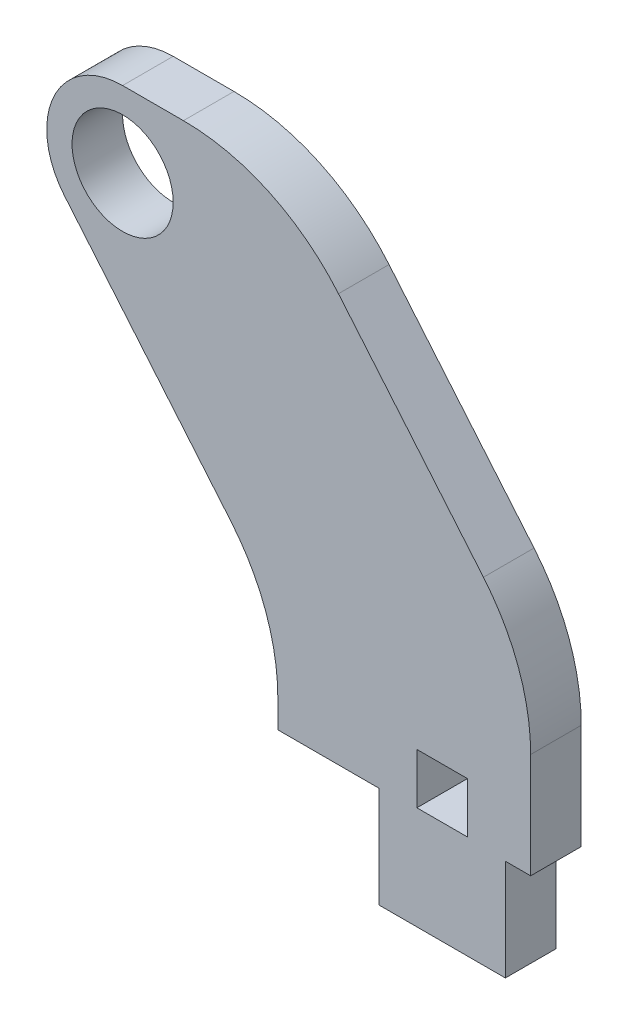
ISO-10303-21;
HEADER;
FILE_DESCRIPTION(('STEP AP214'),'2;1');
FILE_NAME('part.step','',(''),(''),'','','');
FILE_SCHEMA(('AUTOMOTIVE_DESIGN { 1 0 10303 214 1 1 1 1 }'));
ENDSEC;
DATA;
#1=APPLICATION_CONTEXT('core data for automotive mechanical design processes');
#2=APPLICATION_PROTOCOL_DEFINITION('international standard','automotive_design',2000,#1);
#3=PRODUCT_CONTEXT('',#1,'mechanical');
#4=PRODUCT('Part','Part','',(#3));
#5=PRODUCT_RELATED_PRODUCT_CATEGORY('part','',(#4));
#6=PRODUCT_DEFINITION_FORMATION('','',#4);
#7=PRODUCT_DEFINITION_CONTEXT('part definition',#1,'design');
#8=PRODUCT_DEFINITION('design','',#6,#7);
#9=PRODUCT_DEFINITION_SHAPE('','',#8);
#10=(LENGTH_UNIT() NAMED_UNIT(*) SI_UNIT(.MILLI.,.METRE.));
#11=(NAMED_UNIT(*) PLANE_ANGLE_UNIT() SI_UNIT($,.RADIAN.));
#12=(NAMED_UNIT(*) SI_UNIT($,.STERADIAN.) SOLID_ANGLE_UNIT());
#13=UNCERTAINTY_MEASURE_WITH_UNIT(LENGTH_MEASURE(1.E-05),#10,'distance_accuracy_value','');
#14=(GEOMETRIC_REPRESENTATION_CONTEXT(3) GLOBAL_UNCERTAINTY_ASSIGNED_CONTEXT((#13)) GLOBAL_UNIT_ASSIGNED_CONTEXT((#10,
#11,#12)) REPRESENTATION_CONTEXT('',''));
#15=CARTESIAN_POINT('',(0.,0.,0.));
#16=DIRECTION('',(0.,0.,1.));
#17=DIRECTION('',(1.,0.,0.));
#18=AXIS2_PLACEMENT_3D('',#15,#16,#17);
#19=CARTESIAN_POINT('',(-20.066,31.75,3.175));
#20=DIRECTION('',(0.,0.,1.));
#21=DIRECTION('',(1.,0.,0.));
#22=AXIS2_PLACEMENT_3D('',#19,#20,#21);
#23=PLANE('',#22);
#24=DIRECTION('',(0.,1.,0.));
#25=VECTOR('',#24,1.);
#26=CARTESIAN_POINT('',(1.5875,9.652,3.175));
#27=LINE('',#26,#25);
#28=CARTESIAN_POINT('',(1.5875,6.477,3.175));
#29=VERTEX_POINT('',#28);
#30=CARTESIAN_POINT('',(1.5875,9.652,3.175));
#31=VERTEX_POINT('',#30);
#32=EDGE_CURVE('E164',#29,#31,#27,.T.);
#33=ORIENTED_EDGE('',*,*,#32,.F.);
#34=DIRECTION('',(1.,0.,0.));
#35=VECTOR('',#34,1.);
#36=CARTESIAN_POINT('',(-1.5875,6.477,3.175));
#37=LINE('',#36,#35);
#38=CARTESIAN_POINT('',(-1.5875,6.477,3.175));
#39=VERTEX_POINT('',#38);
#40=EDGE_CURVE('E169',#39,#29,#37,.T.);
#41=ORIENTED_EDGE('',*,*,#40,.F.);
#42=DIRECTION('',(0.,-1.,0.));
#43=VECTOR('',#42,1.);
#44=CARTESIAN_POINT('',(-1.5875,9.652,3.175));
#45=LINE('',#44,#43);
#46=CARTESIAN_POINT('',(-1.5875,9.652,3.175));
#47=VERTEX_POINT('',#46);
#48=EDGE_CURVE('E192',#47,#39,#45,.T.);
#49=ORIENTED_EDGE('',*,*,#48,.F.);
#50=DIRECTION('',(-1.,0.,0.));
#51=VECTOR('',#50,1.);
#52=CARTESIAN_POINT('',(-1.5875,9.652,3.175));
#53=LINE('',#52,#51);
#54=EDGE_CURVE('E185',#31,#47,#53,.T.);
#55=ORIENTED_EDGE('',*,*,#54,.F.);
#56=EDGE_LOOP('',(#33,#41,#49,#55));
#57=FACE_BOUND('',#56,.T.);
#58=DIRECTION('',(0.,1.,0.));
#59=VECTOR('',#58,1.);
#60=CARTESIAN_POINT('',(5.55625,6.35,3.175));
#61=LINE('',#60,#59);
#62=CARTESIAN_POINT('',(5.55625,6.35,3.175));
#63=VERTEX_POINT('',#62);
#64=CARTESIAN_POINT('',(5.55625,12.9473421502384,3.175));
#65=VERTEX_POINT('',#64);
#66=EDGE_CURVE('E217',#63,#65,#61,.T.);
#67=ORIENTED_EDGE('',*,*,#66,.T.);
#68=CARTESIAN_POINT('',(-7.14375,12.9473421502384,3.175));
#69=DIRECTION('',(0.,0.,1.));
#70=DIRECTION('',(1.,0.,0.));
#71=AXIS2_PLACEMENT_3D('',#68,#69,#70);
#72=CIRCLE('',#71,12.7);
#73=CARTESIAN_POINT('',(2.59118585036592,21.1033843270089,3.175));
#74=VERTEX_POINT('',#73);
#75=EDGE_CURVE('E293',#65,#74,#72,.T.);
#76=ORIENTED_EDGE('',*,*,#75,.T.);
#77=DIRECTION('',(-0.642208045415005,0.766530381918576,0.));
#78=VECTOR('',#77,1.);
#79=CARTESIAN_POINT('',(-10.31875,36.5125,3.175));
#80=LINE('',#79,#78);
#81=CARTESIAN_POINT('',(-6.51176942761824,31.9685421767706,3.175));
#82=VERTEX_POINT('',#81);
#83=EDGE_CURVE('E220',#74,#82,#80,.T.);
#84=ORIENTED_EDGE('',*,*,#83,.T.);
#85=CARTESIAN_POINT('',(-16.2467052779842,23.8125,3.175));
#86=DIRECTION('',(0.,0.,1.));
#87=DIRECTION('',(1.,0.,0.));
#88=AXIS2_PLACEMENT_3D('',#85,#86,#87);
#89=CIRCLE('',#88,12.7);
#90=CARTESIAN_POINT('',(-16.2467052779842,36.5125,3.175));
#91=VERTEX_POINT('',#90);
#92=EDGE_CURVE('E291',#82,#91,#89,.T.);
#93=ORIENTED_EDGE('',*,*,#92,.T.);
#94=DIRECTION('',(-1.,0.,0.));
#95=VECTOR('',#94,1.);
#96=CARTESIAN_POINT('',(-20.066,36.5125,3.175));
#97=LINE('',#96,#95);
#98=CARTESIAN_POINT('',(-20.066,36.5125,3.175));
#99=VERTEX_POINT('',#98);
#100=EDGE_CURVE('E223',#91,#99,#97,.T.);
#101=ORIENTED_EDGE('',*,*,#100,.T.);
#102=CARTESIAN_POINT('',(-20.066,31.75,3.175));
#103=DIRECTION('',(0.,0.,1.));
#104=DIRECTION('',(1.,0.,0.));
#105=AXIS2_PLACEMENT_3D('',#102,#103,#104);
#106=CIRCLE('',#105,4.7625);
#107=CARTESIAN_POINT('',(-23.7166009438872,28.691484183711,3.175));
#108=VERTEX_POINT('',#107);
#109=EDGE_CURVE('E225',#99,#108,#106,.T.);
#110=ORIENTED_EDGE('',*,*,#109,.T.);
#111=DIRECTION('',(0.642208045415005,-0.766530381918577,0.));
#112=VECTOR('',#111,1.);
#113=CARTESIAN_POINT('',(-23.7166009438872,28.691484183711,3.175));
#114=LINE('',#113,#112);
#115=CARTESIAN_POINT('',(-13.2838141496341,16.2390583647443,3.175));
#116=VERTEX_POINT('',#115);
#117=EDGE_CURVE('E227',#108,#116,#114,.T.);
#118=ORIENTED_EDGE('',*,*,#117,.T.);
#119=CARTESIAN_POINT('',(-23.01875,8.08301618797378,3.175));
#120=DIRECTION('',(0.,0.,1.));
#121=DIRECTION('',(1.,0.,0.));
#122=AXIS2_PLACEMENT_3D('',#119,#120,#121);
#123=CIRCLE('',#122,12.7);
#124=CARTESIAN_POINT('',(-10.31875,8.08301618797378,3.175));
#125=VERTEX_POINT('',#124);
#126=EDGE_CURVE('E11',#116,#125,#123,.F.);
#127=ORIENTED_EDGE('',*,*,#126,.T.);
#128=DIRECTION('',(0.,-1.,0.));
#129=VECTOR('',#128,1.);
#130=CARTESIAN_POINT('',(-10.31875,12.7,3.175));
#131=LINE('',#130,#129);
#132=CARTESIAN_POINT('',(-10.31875,6.35,3.175));
#133=VERTEX_POINT('',#132);
#134=EDGE_CURVE('E229',#125,#133,#131,.T.);
#135=ORIENTED_EDGE('',*,*,#134,.T.);
#136=DIRECTION('',(1.,0.,0.));
#137=VECTOR('',#136,1.);
#138=CARTESIAN_POINT('',(-3.96875,6.35,3.175));
#139=LINE('',#138,#137);
#140=CARTESIAN_POINT('',(-3.96875,6.35,3.175));
#141=VERTEX_POINT('',#140);
#142=EDGE_CURVE('E231',#133,#141,#139,.T.);
#143=ORIENTED_EDGE('',*,*,#142,.T.);
#144=DIRECTION('',(0.,-1.,0.));
#145=VECTOR('',#144,1.);
#146=CARTESIAN_POINT('',(-3.96875,0.,3.175));
#147=LINE('',#146,#145);
#148=CARTESIAN_POINT('',(-3.96875,0.,3.175));
#149=VERTEX_POINT('',#148);
#150=EDGE_CURVE('E207',#141,#149,#147,.T.);
#151=ORIENTED_EDGE('',*,*,#150,.T.);
#152=DIRECTION('',(1.,0.,0.));
#153=VECTOR('',#152,1.);
#154=CARTESIAN_POINT('',(-3.96875,0.,3.175));
#155=LINE('',#154,#153);
#156=CARTESIAN_POINT('',(3.96875,0.,3.175));
#157=VERTEX_POINT('',#156);
#158=EDGE_CURVE('E210',#149,#157,#155,.T.);
#159=ORIENTED_EDGE('',*,*,#158,.T.);
#160=DIRECTION('',(0.,1.,0.));
#161=VECTOR('',#160,1.);
#162=CARTESIAN_POINT('',(3.96875,0.,3.175));
#163=LINE('',#162,#161);
#164=CARTESIAN_POINT('',(3.96875,6.35,3.175));
#165=VERTEX_POINT('',#164);
#166=EDGE_CURVE('E213',#157,#165,#163,.T.);
#167=ORIENTED_EDGE('',*,*,#166,.T.);
#168=DIRECTION('',(1.,0.,0.));
#169=VECTOR('',#168,1.);
#170=CARTESIAN_POINT('',(3.96875,6.35,3.175));
#171=LINE('',#170,#169);
#172=EDGE_CURVE('E215',#165,#63,#171,.T.);
#173=ORIENTED_EDGE('',*,*,#172,.T.);
#174=EDGE_LOOP('',(#67,#76,#84,#93,#101,#110,#118,#127,#135,#143,#151,#159,#167,#173));
#175=FACE_BOUND('',#174,.T.);
#176=CARTESIAN_POINT('',(-20.066,31.75,3.175));
#177=DIRECTION('',(0.,0.,1.));
#178=DIRECTION('',(1.,0.,0.));
#179=AXIS2_PLACEMENT_3D('',#176,#177,#178);
#180=CIRCLE('',#179,3.175);
#181=CARTESIAN_POINT('',(-16.891,31.75,3.175));
#182=VERTEX_POINT('',#181);
#183=EDGE_CURVE('E201',#182,#182,#180,.T.);
#184=ORIENTED_EDGE('',*,*,#183,.F.);
#185=EDGE_LOOP('',(#184));
#186=FACE_BOUND('',#185,.T.);
#187=ADVANCED_FACE('F32',(#57,#175,#186),#23,.T.);
#188=CARTESIAN_POINT('',(-20.066,31.75,0.));
#189=DIRECTION('',(0.,0.,1.));
#190=DIRECTION('',(1.,0.,0.));
#191=AXIS2_PLACEMENT_3D('',#188,#189,#190);
#192=PLANE('',#191);
#193=DIRECTION('',(-1.,0.,0.));
#194=VECTOR('',#193,1.);
#195=CARTESIAN_POINT('',(-1.5875,6.477,0.));
#196=LINE('',#195,#194);
#197=CARTESIAN_POINT('',(1.5875,6.477,0.));
#198=VERTEX_POINT('',#197);
#199=CARTESIAN_POINT('',(-1.5875,6.477,0.));
#200=VERTEX_POINT('',#199);
#201=EDGE_CURVE('E183',#198,#200,#196,.T.);
#202=ORIENTED_EDGE('',*,*,#201,.F.);
#203=DIRECTION('',(0.,-1.,0.));
#204=VECTOR('',#203,1.);
#205=CARTESIAN_POINT('',(1.5875,9.652,0.));
#206=LINE('',#205,#204);
#207=CARTESIAN_POINT('',(1.5875,9.652,0.));
#208=VERTEX_POINT('',#207);
#209=EDGE_CURVE('E161',#208,#198,#206,.T.);
#210=ORIENTED_EDGE('',*,*,#209,.F.);
#211=DIRECTION('',(1.,0.,0.));
#212=VECTOR('',#211,1.);
#213=CARTESIAN_POINT('',(-1.5875,9.652,0.));
#214=LINE('',#213,#212);
#215=CARTESIAN_POINT('',(-1.5875,9.652,0.));
#216=VERTEX_POINT('',#215);
#217=EDGE_CURVE('E173',#216,#208,#214,.T.);
#218=ORIENTED_EDGE('',*,*,#217,.F.);
#219=DIRECTION('',(0.,1.,0.));
#220=VECTOR('',#219,1.);
#221=CARTESIAN_POINT('',(-1.5875,9.652,0.));
#222=LINE('',#221,#220);
#223=EDGE_CURVE('E187',#200,#216,#222,.T.);
#224=ORIENTED_EDGE('',*,*,#223,.F.);
#225=EDGE_LOOP('',(#202,#210,#218,#224));
#226=FACE_BOUND('',#225,.T.);
#227=DIRECTION('',(-0.642208045415005,0.766530381918576,0.));
#228=VECTOR('',#227,1.);
#229=CARTESIAN_POINT('',(-10.31875,36.5125,0.));
#230=LINE('',#229,#228);
#231=CARTESIAN_POINT('',(2.59118585036592,21.1033843270089,0.));
#232=VERTEX_POINT('',#231);
#233=CARTESIAN_POINT('',(-6.51176942761824,31.9685421767706,0.));
#234=VERTEX_POINT('',#233);
#235=EDGE_CURVE('E245',#232,#234,#230,.T.);
#236=ORIENTED_EDGE('',*,*,#235,.F.);
#237=CARTESIAN_POINT('',(-7.14375,12.9473421502384,0.));
#238=DIRECTION('',(0.,0.,1.));
#239=DIRECTION('',(1.,0.,0.));
#240=AXIS2_PLACEMENT_3D('',#237,#238,#239);
#241=CIRCLE('',#240,12.7);
#242=CARTESIAN_POINT('',(5.55625,12.9473421502384,0.));
#243=VERTEX_POINT('',#242);
#244=EDGE_CURVE('E287',#232,#243,#241,.F.);
#245=ORIENTED_EDGE('',*,*,#244,.T.);
#246=DIRECTION('',(0.,1.,0.));
#247=VECTOR('',#246,1.);
#248=CARTESIAN_POINT('',(5.55625,6.35,0.));
#249=LINE('',#248,#247);
#250=CARTESIAN_POINT('',(5.55625,6.35,0.));
#251=VERTEX_POINT('',#250);
#252=EDGE_CURVE('E242',#251,#243,#249,.T.);
#253=ORIENTED_EDGE('',*,*,#252,.F.);
#254=DIRECTION('',(1.,0.,0.));
#255=VECTOR('',#254,1.);
#256=CARTESIAN_POINT('',(3.96875,6.35,0.));
#257=LINE('',#256,#255);
#258=CARTESIAN_POINT('',(3.96875,6.35,0.));
#259=VERTEX_POINT('',#258);
#260=EDGE_CURVE('E240',#259,#251,#257,.T.);
#261=ORIENTED_EDGE('',*,*,#260,.F.);
#262=DIRECTION('',(0.,1.,0.));
#263=VECTOR('',#262,1.);
#264=CARTESIAN_POINT('',(3.96875,0.,0.));
#265=LINE('',#264,#263);
#266=CARTESIAN_POINT('',(3.96875,0.,0.));
#267=VERTEX_POINT('',#266);
#268=EDGE_CURVE('E238',#267,#259,#265,.T.);
#269=ORIENTED_EDGE('',*,*,#268,.F.);
#270=DIRECTION('',(1.,0.,0.));
#271=VECTOR('',#270,1.);
#272=CARTESIAN_POINT('',(-3.96875,0.,0.));
#273=LINE('',#272,#271);
#274=CARTESIAN_POINT('',(-3.96875,0.,0.));
#275=VERTEX_POINT('',#274);
#276=EDGE_CURVE('E236',#275,#267,#273,.T.);
#277=ORIENTED_EDGE('',*,*,#276,.F.);
#278=DIRECTION('',(0.,-1.,0.));
#279=VECTOR('',#278,1.);
#280=CARTESIAN_POINT('',(-3.96875,0.,0.));
#281=LINE('',#280,#279);
#282=CARTESIAN_POINT('',(-3.96875,6.35,0.));
#283=VERTEX_POINT('',#282);
#284=EDGE_CURVE('E204',#283,#275,#281,.T.);
#285=ORIENTED_EDGE('',*,*,#284,.F.);
#286=DIRECTION('',(1.,0.,0.));
#287=VECTOR('',#286,1.);
#288=CARTESIAN_POINT('',(-3.96875,6.35,0.));
#289=LINE('',#288,#287);
#290=CARTESIAN_POINT('',(-10.31875,6.35,0.));
#291=VERTEX_POINT('',#290);
#292=EDGE_CURVE('E211',#291,#283,#289,.T.);
#293=ORIENTED_EDGE('',*,*,#292,.F.);
#294=DIRECTION('',(0.,-1.,0.));
#295=VECTOR('',#294,1.);
#296=CARTESIAN_POINT('',(-10.31875,12.7,0.));
#297=LINE('',#296,#295);
#298=CARTESIAN_POINT('',(-10.31875,8.08301618797378,0.));
#299=VERTEX_POINT('',#298);
#300=EDGE_CURVE('E254',#299,#291,#297,.T.);
#301=ORIENTED_EDGE('',*,*,#300,.F.);
#302=CARTESIAN_POINT('',(-23.01875,8.08301618797378,0.));
#303=DIRECTION('',(0.,0.,1.));
#304=DIRECTION('',(1.,0.,0.));
#305=AXIS2_PLACEMENT_3D('',#302,#303,#304);
#306=CIRCLE('',#305,12.7);
#307=CARTESIAN_POINT('',(-13.2838141496341,16.2390583647443,0.));
#308=VERTEX_POINT('',#307);
#309=EDGE_CURVE('E40',#299,#308,#306,.T.);
#310=ORIENTED_EDGE('',*,*,#309,.T.);
#311=DIRECTION('',(0.642208045415005,-0.766530381918577,0.));
#312=VECTOR('',#311,1.);
#313=CARTESIAN_POINT('',(-23.7166009438872,28.691484183711,0.));
#314=LINE('',#313,#312);
#315=CARTESIAN_POINT('',(-23.7166009438872,28.691484183711,0.));
#316=VERTEX_POINT('',#315);
#317=EDGE_CURVE('E252',#316,#308,#314,.T.);
#318=ORIENTED_EDGE('',*,*,#317,.F.);
#319=CARTESIAN_POINT('',(-20.066,31.75,0.));
#320=DIRECTION('',(0.,0.,1.));
#321=DIRECTION('',(1.,0.,0.));
#322=AXIS2_PLACEMENT_3D('',#319,#320,#321);
#323=CIRCLE('',#322,4.7625);
#324=CARTESIAN_POINT('',(-20.066,36.5125,0.));
#325=VERTEX_POINT('',#324);
#326=EDGE_CURVE('E250',#325,#316,#323,.T.);
#327=ORIENTED_EDGE('',*,*,#326,.F.);
#328=DIRECTION('',(-1.,0.,0.));
#329=VECTOR('',#328,1.);
#330=CARTESIAN_POINT('',(-20.066,36.5125,0.));
#331=LINE('',#330,#329);
#332=CARTESIAN_POINT('',(-16.2467052779842,36.5125,0.));
#333=VERTEX_POINT('',#332);
#334=EDGE_CURVE('E248',#333,#325,#331,.T.);
#335=ORIENTED_EDGE('',*,*,#334,.F.);
#336=CARTESIAN_POINT('',(-16.2467052779842,23.8125,0.));
#337=DIRECTION('',(0.,0.,1.));
#338=DIRECTION('',(1.,0.,0.));
#339=AXIS2_PLACEMENT_3D('',#336,#337,#338);
#340=CIRCLE('',#339,12.7);
#341=EDGE_CURVE('E285',#333,#234,#340,.F.);
#342=ORIENTED_EDGE('',*,*,#341,.T.);
#343=EDGE_LOOP('',(#236,#245,#253,#261,#269,#277,#285,#293,#301,#310,#318,#327,#335,#342));
#344=FACE_BOUND('',#343,.T.);
#345=CARTESIAN_POINT('',(-20.066,31.75,0.));
#346=DIRECTION('',(0.,0.,1.));
#347=DIRECTION('',(1.,0.,0.));
#348=AXIS2_PLACEMENT_3D('',#345,#346,#347);
#349=CIRCLE('',#348,3.175);
#350=CARTESIAN_POINT('',(-16.891,31.75,0.));
#351=VERTEX_POINT('',#350);
#352=EDGE_CURVE('E177',#351,#351,#349,.T.);
#353=ORIENTED_EDGE('',*,*,#352,.T.);
#354=EDGE_LOOP('',(#353));
#355=FACE_BOUND('',#354,.T.);
#356=ADVANCED_FACE('F180',(#226,#344,#355),#192,.F.);
#357=CARTESIAN_POINT('',(-3.96875,0.,3.175));
#358=DIRECTION('',(1.,0.,0.));
#359=DIRECTION('',(0.,0.,-1.));
#360=AXIS2_PLACEMENT_3D('',#357,#358,#359);
#361=PLANE('',#360);
#362=ORIENTED_EDGE('',*,*,#284,.T.);
#363=DIRECTION('',(0.,0.,-1.));
#364=VECTOR('',#363,1.);
#365=CARTESIAN_POINT('',(-3.96875,0.,3.175));
#366=LINE('',#365,#364);
#367=EDGE_CURVE('E277',#149,#275,#366,.T.);
#368=ORIENTED_EDGE('',*,*,#367,.F.);
#369=ORIENTED_EDGE('',*,*,#150,.F.);
#370=DIRECTION('',(0.,0.,-1.));
#371=VECTOR('',#370,1.);
#372=CARTESIAN_POINT('',(-3.96875,6.35,3.175));
#373=LINE('',#372,#371);
#374=EDGE_CURVE('E233',#141,#283,#373,.T.);
#375=ORIENTED_EDGE('',*,*,#374,.T.);
#376=EDGE_LOOP('',(#362,#368,#369,#375));
#377=FACE_BOUND('',#376,.T.);
#378=ADVANCED_FACE('F323',(#377),#361,.F.);
#379=CARTESIAN_POINT('',(-3.96875,0.,3.175));
#380=DIRECTION('',(0.,1.,0.));
#381=DIRECTION('',(0.,0.,1.));
#382=AXIS2_PLACEMENT_3D('',#379,#380,#381);
#383=PLANE('',#382);
#384=ORIENTED_EDGE('',*,*,#276,.T.);
#385=DIRECTION('',(0.,0.,-1.));
#386=VECTOR('',#385,1.);
#387=CARTESIAN_POINT('',(3.96875,0.,3.175));
#388=LINE('',#387,#386);
#389=EDGE_CURVE('E274',#157,#267,#388,.T.);
#390=ORIENTED_EDGE('',*,*,#389,.F.);
#391=ORIENTED_EDGE('',*,*,#158,.F.);
#392=ORIENTED_EDGE('',*,*,#367,.T.);
#393=EDGE_LOOP('',(#384,#390,#391,#392));
#394=FACE_BOUND('',#393,.T.);
#395=ADVANCED_FACE('F325',(#394),#383,.F.);
#396=CARTESIAN_POINT('',(3.96875,0.,3.175));
#397=DIRECTION('',(-1.,0.,0.));
#398=DIRECTION('',(0.,0.,1.));
#399=AXIS2_PLACEMENT_3D('',#396,#397,#398);
#400=PLANE('',#399);
#401=ORIENTED_EDGE('',*,*,#268,.T.);
#402=DIRECTION('',(0.,0.,-1.));
#403=VECTOR('',#402,1.);
#404=CARTESIAN_POINT('',(3.96875,6.35,3.175));
#405=LINE('',#404,#403);
#406=EDGE_CURVE('E271',#165,#259,#405,.T.);
#407=ORIENTED_EDGE('',*,*,#406,.F.);
#408=ORIENTED_EDGE('',*,*,#166,.F.);
#409=ORIENTED_EDGE('',*,*,#389,.T.);
#410=EDGE_LOOP('',(#401,#407,#408,#409));
#411=FACE_BOUND('',#410,.T.);
#412=ADVANCED_FACE('F332',(#411),#400,.F.);
#413=CARTESIAN_POINT('',(3.96875,6.35,3.175));
#414=DIRECTION('',(0.,1.,0.));
#415=DIRECTION('',(0.,0.,1.));
#416=AXIS2_PLACEMENT_3D('',#413,#414,#415);
#417=PLANE('',#416);
#418=ORIENTED_EDGE('',*,*,#260,.T.);
#419=DIRECTION('',(0.,0.,-1.));
#420=VECTOR('',#419,1.);
#421=CARTESIAN_POINT('',(5.55625,6.35,3.175));
#422=LINE('',#421,#420);
#423=EDGE_CURVE('E268',#63,#251,#422,.T.);
#424=ORIENTED_EDGE('',*,*,#423,.F.);
#425=ORIENTED_EDGE('',*,*,#172,.F.);
#426=ORIENTED_EDGE('',*,*,#406,.T.);
#427=EDGE_LOOP('',(#418,#424,#425,#426));
#428=FACE_BOUND('',#427,.T.);
#429=ADVANCED_FACE('F336',(#428),#417,.F.);
#430=CARTESIAN_POINT('',(5.55625,6.35,3.175));
#431=DIRECTION('',(-1.,0.,0.));
#432=DIRECTION('',(0.,-1.,0.));
#433=AXIS2_PLACEMENT_3D('',#430,#431,#432);
#434=PLANE('',#433);
#435=ORIENTED_EDGE('',*,*,#252,.T.);
#436=DIRECTION('',(0.,0.,-1.));
#437=VECTOR('',#436,1.);
#438=CARTESIAN_POINT('',(5.55625,12.9473421502384,3.175));
#439=LINE('',#438,#437);
#440=EDGE_CURVE('E289',#243,#65,#439,.F.);
#441=ORIENTED_EDGE('',*,*,#440,.T.);
#442=ORIENTED_EDGE('',*,*,#66,.F.);
#443=ORIENTED_EDGE('',*,*,#423,.T.);
#444=EDGE_LOOP('',(#435,#441,#442,#443));
#445=FACE_BOUND('',#444,.T.);
#446=ADVANCED_FACE('F340',(#445),#434,.F.);
#447=CARTESIAN_POINT('',(-10.31875,36.5125,3.175));
#448=DIRECTION('',(-0.766530381918577,-0.642208045415005,0.));
#449=DIRECTION('',(0.642208045415005,-0.766530381918577,0.));
#450=AXIS2_PLACEMENT_3D('',#447,#448,#449);
#451=PLANE('',#450);
#452=ORIENTED_EDGE('',*,*,#83,.F.);
#453=DIRECTION('',(0.,0.,-1.));
#454=VECTOR('',#453,1.);
#455=CARTESIAN_POINT('',(2.59118585036592,21.1033843270089,3.175));
#456=LINE('',#455,#454);
#457=EDGE_CURVE('E282',#74,#232,#456,.T.);
#458=ORIENTED_EDGE('',*,*,#457,.T.);
#459=ORIENTED_EDGE('',*,*,#235,.T.);
#460=DIRECTION('',(0.,0.,-1.));
#461=VECTOR('',#460,1.);
#462=CARTESIAN_POINT('',(-6.51176942761824,31.9685421767706,3.175));
#463=LINE('',#462,#461);
#464=EDGE_CURVE('E280',#234,#82,#463,.F.);
#465=ORIENTED_EDGE('',*,*,#464,.T.);
#466=EDGE_LOOP('',(#452,#458,#459,#465));
#467=FACE_BOUND('',#466,.T.);
#468=ADVANCED_FACE('F348',(#467),#451,.F.);
#469=CARTESIAN_POINT('',(-20.066,36.5125,3.175));
#470=DIRECTION('',(0.,-1.,0.));
#471=DIRECTION('',(0.,0.,-1.));
#472=AXIS2_PLACEMENT_3D('',#469,#470,#471);
#473=PLANE('',#472);
#474=ORIENTED_EDGE('',*,*,#100,.F.);
#475=DIRECTION('',(0.,0.,-1.));
#476=VECTOR('',#475,1.);
#477=CARTESIAN_POINT('',(-16.2467052779842,36.5125,3.175));
#478=LINE('',#477,#476);
#479=EDGE_CURVE('E295',#91,#333,#478,.T.);
#480=ORIENTED_EDGE('',*,*,#479,.T.);
#481=ORIENTED_EDGE('',*,*,#334,.T.);
#482=DIRECTION('',(0.,0.,-1.));
#483=VECTOR('',#482,1.);
#484=CARTESIAN_POINT('',(-20.066,36.5125,3.175));
#485=LINE('',#484,#483);
#486=EDGE_CURVE('E265',#99,#325,#485,.T.);
#487=ORIENTED_EDGE('',*,*,#486,.F.);
#488=EDGE_LOOP('',(#474,#480,#481,#487));
#489=FACE_BOUND('',#488,.T.);
#490=ADVANCED_FACE('F357',(#489),#473,.F.);
#491=CARTESIAN_POINT('',(-20.066,31.75,3.175));
#492=DIRECTION('',(0.,0.,-1.));
#493=DIRECTION('',(-1.,0.,0.));
#494=AXIS2_PLACEMENT_3D('',#491,#492,#493);
#495=CYLINDRICAL_SURFACE('',#494,4.7625);
#496=ORIENTED_EDGE('',*,*,#326,.T.);
#497=DIRECTION('',(0.,0.,-1.));
#498=VECTOR('',#497,1.);
#499=CARTESIAN_POINT('',(-23.7166009438872,28.691484183711,3.175));
#500=LINE('',#499,#498);
#501=EDGE_CURVE('E262',#108,#316,#500,.T.);
#502=ORIENTED_EDGE('',*,*,#501,.F.);
#503=ORIENTED_EDGE('',*,*,#109,.F.);
#504=ORIENTED_EDGE('',*,*,#486,.T.);
#505=EDGE_LOOP('',(#496,#502,#503,#504));
#506=FACE_BOUND('',#505,.T.);
#507=ADVANCED_FACE('F361',(#506),#495,.T.);
#508=CARTESIAN_POINT('',(-23.7166009438872,28.691484183711,3.175));
#509=DIRECTION('',(0.766530381918577,0.642208045415005,0.));
#510=DIRECTION('',(-0.642208045415005,0.766530381918577,0.));
#511=AXIS2_PLACEMENT_3D('',#508,#509,#510);
#512=PLANE('',#511);
#513=ORIENTED_EDGE('',*,*,#317,.T.);
#514=DIRECTION('',(0.,0.,-1.));
#515=VECTOR('',#514,1.);
#516=CARTESIAN_POINT('',(-13.2838141496341,16.2390583647443,3.175));
#517=LINE('',#516,#515);
#518=EDGE_CURVE('E53',#308,#116,#517,.F.);
#519=ORIENTED_EDGE('',*,*,#518,.T.);
#520=ORIENTED_EDGE('',*,*,#117,.F.);
#521=ORIENTED_EDGE('',*,*,#501,.T.);
#522=EDGE_LOOP('',(#513,#519,#520,#521));
#523=FACE_BOUND('',#522,.T.);
#524=ADVANCED_FACE('F309',(#523),#512,.F.);
#525=CARTESIAN_POINT('',(-10.31875,12.7,3.175));
#526=DIRECTION('',(1.,0.,0.));
#527=DIRECTION('',(0.,1.,0.));
#528=AXIS2_PLACEMENT_3D('',#525,#526,#527);
#529=PLANE('',#528);
#530=ORIENTED_EDGE('',*,*,#134,.F.);
#531=DIRECTION('',(0.,0.,-1.));
#532=VECTOR('',#531,1.);
#533=CARTESIAN_POINT('',(-10.31875,8.08301618797378,0.));
#534=LINE('',#533,#532);
#535=EDGE_CURVE('E298',#125,#299,#534,.T.);
#536=ORIENTED_EDGE('',*,*,#535,.T.);
#537=ORIENTED_EDGE('',*,*,#300,.T.);
#538=DIRECTION('',(0.,0.,-1.));
#539=VECTOR('',#538,1.);
#540=CARTESIAN_POINT('',(-10.31875,6.35,3.175));
#541=LINE('',#540,#539);
#542=EDGE_CURVE('E259',#133,#291,#541,.T.);
#543=ORIENTED_EDGE('',*,*,#542,.F.);
#544=EDGE_LOOP('',(#530,#536,#537,#543));
#545=FACE_BOUND('',#544,.T.);
#546=ADVANCED_FACE('F312',(#545),#529,.F.);
#547=CARTESIAN_POINT('',(-3.96875,6.35,3.175));
#548=DIRECTION('',(0.,1.,0.));
#549=DIRECTION('',(-1.,0.,0.));
#550=AXIS2_PLACEMENT_3D('',#547,#548,#549);
#551=PLANE('',#550);
#552=ORIENTED_EDGE('',*,*,#292,.T.);
#553=ORIENTED_EDGE('',*,*,#374,.F.);
#554=ORIENTED_EDGE('',*,*,#142,.F.);
#555=ORIENTED_EDGE('',*,*,#542,.T.);
#556=EDGE_LOOP('',(#552,#553,#554,#555));
#557=FACE_BOUND('',#556,.T.);
#558=ADVANCED_FACE('F320',(#557),#551,.F.);
#559=CARTESIAN_POINT('',(-20.066,31.75,3.175));
#560=DIRECTION('',(0.,0.,-1.));
#561=DIRECTION('',(-1.,0.,0.));
#562=AXIS2_PLACEMENT_3D('',#559,#560,#561);
#563=CYLINDRICAL_SURFACE('',#562,3.175);
#564=ORIENTED_EDGE('',*,*,#183,.T.);
#565=EDGE_LOOP('',(#564));
#566=FACE_BOUND('',#565,.T.);
#567=ORIENTED_EDGE('',*,*,#352,.F.);
#568=EDGE_LOOP('',(#567));
#569=FACE_BOUND('',#568,.T.);
#570=ADVANCED_FACE('F378',(#566,#569),#563,.F.);
#571=CARTESIAN_POINT('',(1.5875,9.652,-0.00100000000000013));
#572=DIRECTION('',(1.,0.,0.));
#573=DIRECTION('',(0.,1.,0.));
#574=AXIS2_PLACEMENT_3D('',#571,#572,#573);
#575=PLANE('',#574);
#576=ORIENTED_EDGE('',*,*,#209,.T.);
#577=DIRECTION('',(0.,0.,1.));
#578=VECTOR('',#577,1.);
#579=CARTESIAN_POINT('',(1.5875,6.477,-0.00100000000000013));
#580=LINE('',#579,#578);
#581=EDGE_CURVE('E178',#198,#29,#580,.T.);
#582=ORIENTED_EDGE('',*,*,#581,.T.);
#583=ORIENTED_EDGE('',*,*,#32,.T.);
#584=DIRECTION('',(0.,0.,1.));
#585=VECTOR('',#584,1.);
#586=CARTESIAN_POINT('',(1.5875,9.652,-0.00100000000000013));
#587=LINE('',#586,#585);
#588=EDGE_CURVE('E157',#208,#31,#587,.T.);
#589=ORIENTED_EDGE('',*,*,#588,.F.);
#590=EDGE_LOOP('',(#576,#582,#583,#589));
#591=FACE_BOUND('',#590,.T.);
#592=ADVANCED_FACE('F159',(#591),#575,.F.);
#593=CARTESIAN_POINT('',(-1.5875,6.477,-0.00100000000000013));
#594=DIRECTION('',(0.,-1.,0.));
#595=DIRECTION('',(0.,0.,-1.));
#596=AXIS2_PLACEMENT_3D('',#593,#594,#595);
#597=PLANE('',#596);
#598=ORIENTED_EDGE('',*,*,#201,.T.);
#599=DIRECTION('',(0.,0.,1.));
#600=VECTOR('',#599,1.);
#601=CARTESIAN_POINT('',(-1.5875,6.477,-0.00100000000000013));
#602=LINE('',#601,#600);
#603=EDGE_CURVE('E198',#200,#39,#602,.T.);
#604=ORIENTED_EDGE('',*,*,#603,.T.);
#605=ORIENTED_EDGE('',*,*,#40,.T.);
#606=ORIENTED_EDGE('',*,*,#581,.F.);
#607=EDGE_LOOP('',(#598,#604,#605,#606));
#608=FACE_BOUND('',#607,.T.);
#609=ADVANCED_FACE('F405',(#608),#597,.F.);
#610=CARTESIAN_POINT('',(-1.5875,9.652,-0.00100000000000013));
#611=DIRECTION('',(-1.,0.,0.));
#612=DIRECTION('',(0.,-1.,0.));
#613=AXIS2_PLACEMENT_3D('',#610,#611,#612);
#614=PLANE('',#613);
#615=ORIENTED_EDGE('',*,*,#223,.T.);
#616=DIRECTION('',(0.,0.,1.));
#617=VECTOR('',#616,1.);
#618=CARTESIAN_POINT('',(-1.5875,9.652,-0.00100000000000013));
#619=LINE('',#618,#617);
#620=EDGE_CURVE('E168',#216,#47,#619,.T.);
#621=ORIENTED_EDGE('',*,*,#620,.T.);
#622=ORIENTED_EDGE('',*,*,#48,.T.);
#623=ORIENTED_EDGE('',*,*,#603,.F.);
#624=EDGE_LOOP('',(#615,#621,#622,#623));
#625=FACE_BOUND('',#624,.T.);
#626=ADVANCED_FACE('F411',(#625),#614,.F.);
#627=CARTESIAN_POINT('',(-1.5875,9.652,-0.00100000000000013));
#628=DIRECTION('',(0.,1.,0.));
#629=DIRECTION('',(0.,0.,1.));
#630=AXIS2_PLACEMENT_3D('',#627,#628,#629);
#631=PLANE('',#630);
#632=ORIENTED_EDGE('',*,*,#217,.T.);
#633=ORIENTED_EDGE('',*,*,#588,.T.);
#634=ORIENTED_EDGE('',*,*,#54,.T.);
#635=ORIENTED_EDGE('',*,*,#620,.F.);
#636=EDGE_LOOP('',(#632,#633,#634,#635));
#637=FACE_BOUND('',#636,.T.);
#638=ADVANCED_FACE('F174',(#637),#631,.F.);
#639=CARTESIAN_POINT('',(-7.14375,12.9473421502384,3.175));
#640=DIRECTION('',(0.,0.,-1.));
#641=DIRECTION('',(-1.,0.,0.));
#642=AXIS2_PLACEMENT_3D('',#639,#640,#641);
#643=CYLINDRICAL_SURFACE('',#642,12.7);
#644=ORIENTED_EDGE('',*,*,#75,.F.);
#645=ORIENTED_EDGE('',*,*,#440,.F.);
#646=ORIENTED_EDGE('',*,*,#244,.F.);
#647=ORIENTED_EDGE('',*,*,#457,.F.);
#648=EDGE_LOOP('',(#644,#645,#646,#647));
#649=FACE_BOUND('',#648,.T.);
#650=ADVANCED_FACE('F346',(#649),#643,.T.);
#651=CARTESIAN_POINT('',(-16.2467052779842,23.8125,3.175));
#652=DIRECTION('',(0.,0.,-1.));
#653=DIRECTION('',(-1.,0.,0.));
#654=AXIS2_PLACEMENT_3D('',#651,#652,#653);
#655=CYLINDRICAL_SURFACE('',#654,12.7);
#656=ORIENTED_EDGE('',*,*,#92,.F.);
#657=ORIENTED_EDGE('',*,*,#464,.F.);
#658=ORIENTED_EDGE('',*,*,#341,.F.);
#659=ORIENTED_EDGE('',*,*,#479,.F.);
#660=EDGE_LOOP('',(#656,#657,#658,#659));
#661=FACE_BOUND('',#660,.T.);
#662=ADVANCED_FACE('F354',(#661),#655,.T.);
#663=CARTESIAN_POINT('',(-23.01875,8.08301618797378,3.175));
#664=DIRECTION('',(0.,0.,1.));
#665=DIRECTION('',(1.,0.,0.));
#666=AXIS2_PLACEMENT_3D('',#663,#664,#665);
#667=CYLINDRICAL_SURFACE('',#666,12.7);
#668=ORIENTED_EDGE('',*,*,#126,.F.);
#669=ORIENTED_EDGE('',*,*,#518,.F.);
#670=ORIENTED_EDGE('',*,*,#309,.F.);
#671=ORIENTED_EDGE('',*,*,#535,.F.);
#672=EDGE_LOOP('',(#668,#669,#670,#671));
#673=FACE_BOUND('',#672,.T.);
#674=ADVANCED_FACE('F34',(#673),#667,.F.);
#675=CLOSED_SHELL('',(#187,#356,#378,#395,#412,#429,#446,#468,#490,#507,#524,#546,#558,#570,
#592,#609,#626,#638,#650,#662,#674));
#676=MANIFOLD_SOLID_BREP('B2',#675);
#677=ADVANCED_BREP_SHAPE_REPRESENTATION('',(#18,#676),#14);
#678=SHAPE_DEFINITION_REPRESENTATION(#9,#677);
ENDSEC;
END-ISO-10303-21;
